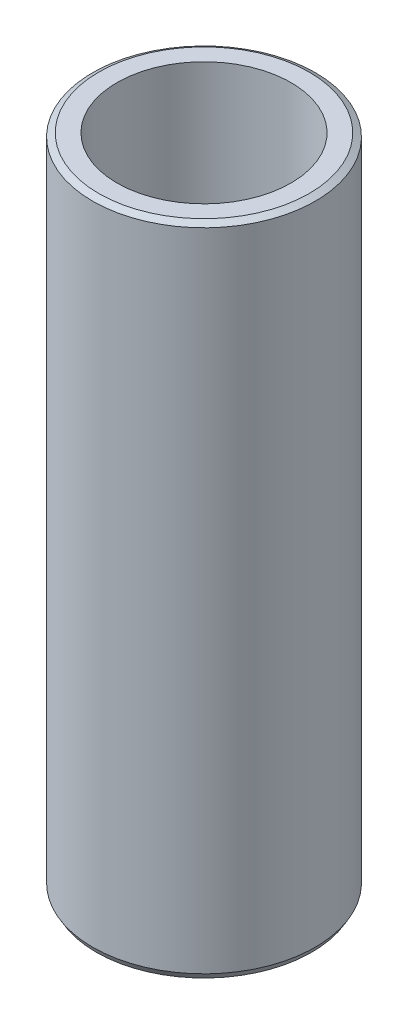
ISO-10303-21;
HEADER;
FILE_DESCRIPTION(('STEP AP214'),'2;1');
FILE_NAME('part.step','',(''),(''),'','','');
FILE_SCHEMA(('AUTOMOTIVE_DESIGN { 1 0 10303 214 1 1 1 1 }'));
ENDSEC;
DATA;
#1=APPLICATION_CONTEXT('core data for automotive mechanical design processes');
#2=APPLICATION_PROTOCOL_DEFINITION('international standard','automotive_design',2000,#1);
#3=PRODUCT_CONTEXT('',#1,'mechanical');
#4=PRODUCT('Part','Part','',(#3));
#5=PRODUCT_RELATED_PRODUCT_CATEGORY('part','',(#4));
#6=PRODUCT_DEFINITION_FORMATION('','',#4);
#7=PRODUCT_DEFINITION_CONTEXT('part definition',#1,'design');
#8=PRODUCT_DEFINITION('design','',#6,#7);
#9=PRODUCT_DEFINITION_SHAPE('','',#8);
#10=(LENGTH_UNIT() NAMED_UNIT(*) SI_UNIT(.MILLI.,.METRE.));
#11=(NAMED_UNIT(*) PLANE_ANGLE_UNIT() SI_UNIT($,.RADIAN.));
#12=(NAMED_UNIT(*) SI_UNIT($,.STERADIAN.) SOLID_ANGLE_UNIT());
#13=UNCERTAINTY_MEASURE_WITH_UNIT(LENGTH_MEASURE(1.E-05),#10,'distance_accuracy_value','');
#14=(GEOMETRIC_REPRESENTATION_CONTEXT(3) GLOBAL_UNCERTAINTY_ASSIGNED_CONTEXT((#13)) GLOBAL_UNIT_ASSIGNED_CONTEXT((#10,
#11,#12)) REPRESENTATION_CONTEXT('',''));
#15=CARTESIAN_POINT('',(0.,0.,0.));
#16=DIRECTION('',(0.,0.,1.));
#17=DIRECTION('',(1.,0.,0.));
#18=AXIS2_PLACEMENT_3D('',#15,#16,#17);
#19=CARTESIAN_POINT('',(0.,265.001873523138,0.));
#20=DIRECTION('',(0.,-1.,0.));
#21=DIRECTION('',(0.,0.,-1.));
#22=AXIS2_PLACEMENT_3D('',#19,#20,#21);
#23=CYLINDRICAL_SURFACE('',#22,45.);
#24=CARTESIAN_POINT('',(0.,263.568546797167,0.));
#25=DIRECTION('',(0.,1.,0.));
#26=DIRECTION('',(0.,0.,1.));
#27=AXIS2_PLACEMENT_3D('',#24,#25,#26);
#28=CIRCLE('',#27,45.);
#29=CARTESIAN_POINT('',(0.,263.568546797167,45.));
#30=VERTEX_POINT('',#29);
#31=EDGE_CURVE('E50',#30,#30,#28,.F.);
#32=ORIENTED_EDGE('',*,*,#31,.T.);
#33=EDGE_LOOP('',(#32));
#34=FACE_BOUND('',#33,.T.);
#35=CARTESIAN_POINT('',(0.,2.4825947132282,0.));
#36=DIRECTION('',(0.,1.,0.));
#37=DIRECTION('',(0.,0.,1.));
#38=AXIS2_PLACEMENT_3D('',#35,#36,#37);
#39=CIRCLE('',#38,45.);
#40=CARTESIAN_POINT('',(0.,2.4825947132282,45.));
#41=VERTEX_POINT('',#40);
#42=EDGE_CURVE('E51',#41,#41,#39,.T.);
#43=ORIENTED_EDGE('',*,*,#42,.T.);
#44=EDGE_LOOP('',(#43));
#45=FACE_BOUND('',#44,.T.);
#46=ADVANCED_FACE('F39',(#34,#45),#23,.T.);
#47=CARTESIAN_POINT('',(0.,265.001873523138,0.));
#48=DIRECTION('',(0.,1.,0.));
#49=DIRECTION('',(0.,0.,1.));
#50=AXIS2_PLACEMENT_3D('',#47,#48,#49);
#51=PLANE('',#50);
#52=CARTESIAN_POINT('',(0.,265.001873523138,0.));
#53=DIRECTION('',(0.,1.,0.));
#54=DIRECTION('',(0.,0.,1.));
#55=AXIS2_PLACEMENT_3D('',#52,#53,#54);
#56=CIRCLE('',#55,42.5174052867718);
#57=CARTESIAN_POINT('',(0.,265.001873523138,42.5174052867718));
#58=VERTEX_POINT('',#57);
#59=EDGE_CURVE('E54',#58,#58,#56,.T.);
#60=ORIENTED_EDGE('',*,*,#59,.T.);
#61=EDGE_LOOP('',(#60));
#62=FACE_BOUND('',#61,.T.);
#63=CARTESIAN_POINT('',(0.,265.001873523138,0.));
#64=DIRECTION('',(0.,1.,0.));
#65=DIRECTION('',(0.,0.,1.));
#66=AXIS2_PLACEMENT_3D('',#63,#64,#65);
#67=CIRCLE('',#66,35.1724087659407);
#68=CARTESIAN_POINT('',(0.,265.001873523138,35.1724087659407));
#69=VERTEX_POINT('',#68);
#70=EDGE_CURVE('E58',#69,#69,#67,.T.);
#71=ORIENTED_EDGE('',*,*,#70,.F.);
#72=EDGE_LOOP('',(#71));
#73=FACE_BOUND('',#72,.T.);
#74=ADVANCED_FACE('F69',(#62,#73),#51,.T.);
#75=CARTESIAN_POINT('',(0.,0.,0.));
#76=DIRECTION('',(0.,1.,0.));
#77=DIRECTION('',(0.,0.,1.));
#78=AXIS2_PLACEMENT_3D('',#75,#76,#77);
#79=PLANE('',#78);
#80=CARTESIAN_POINT('',(0.,0.,0.));
#81=DIRECTION('',(0.,1.,0.));
#82=DIRECTION('',(0.,0.,1.));
#83=AXIS2_PLACEMENT_3D('',#80,#81,#82);
#84=CIRCLE('',#83,43.5666732740289);
#85=CARTESIAN_POINT('',(0.,0.,43.5666732740289));
#86=VERTEX_POINT('',#85);
#87=EDGE_CURVE('E10',#86,#86,#84,.F.);
#88=ORIENTED_EDGE('',*,*,#87,.T.);
#89=EDGE_LOOP('',(#88));
#90=FACE_BOUND('',#89,.T.);
#91=CARTESIAN_POINT('',(0.,0.,0.));
#92=DIRECTION('',(0.,1.,0.));
#93=DIRECTION('',(0.,0.,1.));
#94=AXIS2_PLACEMENT_3D('',#91,#92,#93);
#95=CIRCLE('',#94,35.1724087659407);
#96=CARTESIAN_POINT('',(0.,0.,35.1724087659407));
#97=VERTEX_POINT('',#96);
#98=EDGE_CURVE('E63',#97,#97,#95,.T.);
#99=ORIENTED_EDGE('',*,*,#98,.T.);
#100=EDGE_LOOP('',(#99));
#101=FACE_BOUND('',#100,.T.);
#102=ADVANCED_FACE('F75',(#90,#101),#79,.F.);
#103=CARTESIAN_POINT('',(0.,265.001873523138,0.));
#104=DIRECTION('',(0.,-1.,0.));
#105=DIRECTION('',(0.,0.,-1.));
#106=AXIS2_PLACEMENT_3D('',#103,#104,#105);
#107=CYLINDRICAL_SURFACE('',#106,35.1724087659407);
#108=ORIENTED_EDGE('',*,*,#70,.T.);
#109=EDGE_LOOP('',(#108));
#110=FACE_BOUND('',#109,.T.);
#111=ORIENTED_EDGE('',*,*,#98,.F.);
#112=EDGE_LOOP('',(#111));
#113=FACE_BOUND('',#112,.T.);
#114=ADVANCED_FACE('F70',(#110,#113),#107,.F.);
#115=CARTESIAN_POINT('',(0.,265.001873523138,0.));
#116=DIRECTION('',(0.,-1.,0.));
#117=DIRECTION('',(0.,0.,-1.));
#118=AXIS2_PLACEMENT_3D('',#115,#116,#117);
#119=CONICAL_SURFACE('',#118,42.5174052867718,1.0471975511966);
#120=ORIENTED_EDGE('',*,*,#31,.F.);
#121=EDGE_LOOP('',(#120));
#122=FACE_BOUND('',#121,.T.);
#123=ORIENTED_EDGE('',*,*,#59,.F.);
#124=EDGE_LOOP('',(#123));
#125=FACE_BOUND('',#124,.T.);
#126=ADVANCED_FACE('F81',(#122,#125),#119,.T.);
#127=CARTESIAN_POINT('',(0.,2.4825947132282,0.));
#128=DIRECTION('',(0.,1.,0.));
#129=DIRECTION('',(0.,0.,1.));
#130=AXIS2_PLACEMENT_3D('',#127,#128,#129);
#131=CONICAL_SURFACE('',#130,45.,0.523598775598305);
#132=ORIENTED_EDGE('',*,*,#87,.F.);
#133=EDGE_LOOP('',(#132));
#134=FACE_BOUND('',#133,.T.);
#135=ORIENTED_EDGE('',*,*,#42,.F.);
#136=EDGE_LOOP('',(#135));
#137=FACE_BOUND('',#136,.T.);
#138=ADVANCED_FACE('F45',(#134,#137),#131,.T.);
#139=CLOSED_SHELL('',(#46,#74,#102,#114,#126,#138));
#140=MANIFOLD_SOLID_BREP('B2',#139);
#141=ADVANCED_BREP_SHAPE_REPRESENTATION('',(#18,#140),#14);
#142=SHAPE_DEFINITION_REPRESENTATION(#9,#141);
ENDSEC;
END-ISO-10303-21;
